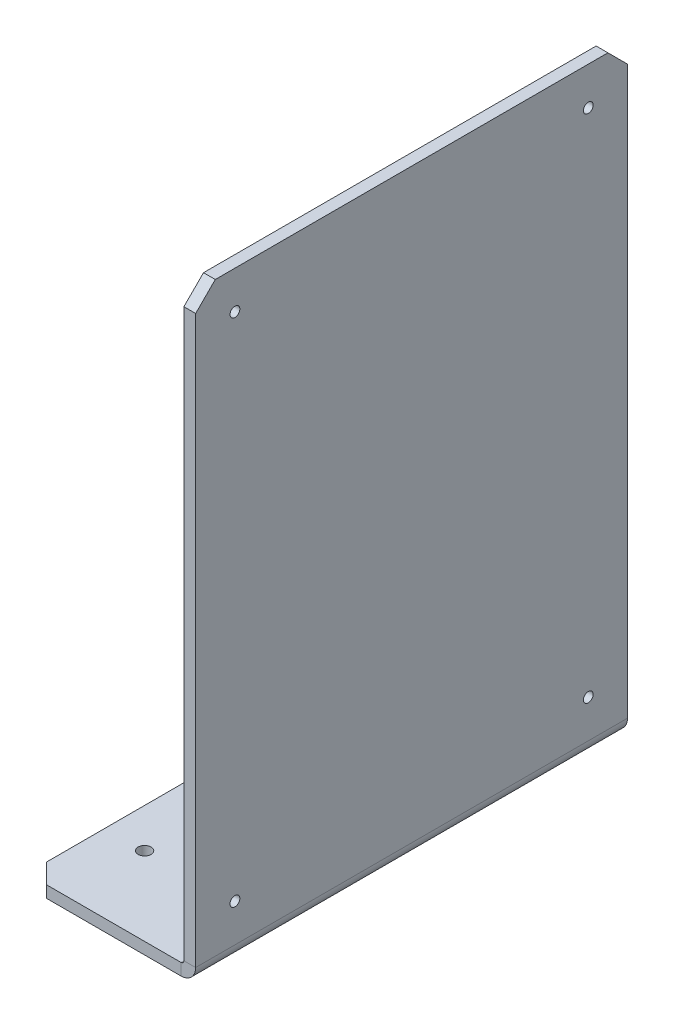
ISO-10303-21;
HEADER;
FILE_DESCRIPTION(('STEP AP214'),'2;1');
FILE_NAME('part.step','',(''),(''),'','','');
FILE_SCHEMA(('AUTOMOTIVE_DESIGN { 1 0 10303 214 1 1 1 1 }'));
ENDSEC;
DATA;
#1=APPLICATION_CONTEXT('core data for automotive mechanical design processes');
#2=APPLICATION_PROTOCOL_DEFINITION('international standard','automotive_design',2000,#1);
#3=PRODUCT_CONTEXT('',#1,'mechanical');
#4=PRODUCT('Part','Part','',(#3));
#5=PRODUCT_RELATED_PRODUCT_CATEGORY('part','',(#4));
#6=PRODUCT_DEFINITION_FORMATION('','',#4);
#7=PRODUCT_DEFINITION_CONTEXT('part definition',#1,'design');
#8=PRODUCT_DEFINITION('design','',#6,#7);
#9=PRODUCT_DEFINITION_SHAPE('','',#8);
#10=(LENGTH_UNIT() NAMED_UNIT(*) SI_UNIT(.MILLI.,.METRE.));
#11=(NAMED_UNIT(*) PLANE_ANGLE_UNIT() SI_UNIT($,.RADIAN.));
#12=(NAMED_UNIT(*) SI_UNIT($,.STERADIAN.) SOLID_ANGLE_UNIT());
#13=UNCERTAINTY_MEASURE_WITH_UNIT(LENGTH_MEASURE(1.E-05),#10,'distance_accuracy_value','');
#14=(GEOMETRIC_REPRESENTATION_CONTEXT(3) GLOBAL_UNCERTAINTY_ASSIGNED_CONTEXT((#13)) GLOBAL_UNIT_ASSIGNED_CONTEXT((#10,
#11,#12)) REPRESENTATION_CONTEXT('',''));
#15=CARTESIAN_POINT('',(0.,0.,0.));
#16=DIRECTION('',(0.,0.,1.));
#17=DIRECTION('',(1.,0.,0.));
#18=AXIS2_PLACEMENT_3D('',#15,#16,#17);
#19=CARTESIAN_POINT('',(0.,0.7366,110.));
#20=DIRECTION('',(0.,0.,1.));
#21=DIRECTION('',(1.,0.,0.));
#22=AXIS2_PLACEMENT_3D('',#19,#20,#21);
#23=PLANE('',#22);
#24=DIRECTION('',(1.,0.,0.));
#25=VECTOR('',#24,1.);
#26=CARTESIAN_POINT('',(0.,0.7366,110.));
#27=LINE('',#26,#25);
#28=CARTESIAN_POINT('',(0.,0.7366,110.));
#29=VERTEX_POINT('',#28);
#30=CARTESIAN_POINT('',(3.,0.7366,110.));
#31=VERTEX_POINT('',#30);
#32=EDGE_CURVE('E135',#29,#31,#27,.T.);
#33=ORIENTED_EDGE('',*,*,#32,.F.);
#34=CARTESIAN_POINT('',(-0.736599999999998,0.7366,110.));
#35=DIRECTION('',(0.,0.,-1.));
#36=DIRECTION('',(-1.,0.,0.));
#37=AXIS2_PLACEMENT_3D('',#34,#35,#36);
#38=CIRCLE('',#37,0.7366);
#39=CARTESIAN_POINT('',(-0.736599999999997,0.,110.));
#40=VERTEX_POINT('',#39);
#41=EDGE_CURVE('E139',#40,#29,#38,.F.);
#42=ORIENTED_EDGE('',*,*,#41,.F.);
#43=DIRECTION('',(0.,1.,0.));
#44=VECTOR('',#43,1.);
#45=CARTESIAN_POINT('',(-0.736599999999992,-3.,110.));
#46=LINE('',#45,#44);
#47=CARTESIAN_POINT('',(-0.736599999999992,-3.,110.));
#48=VERTEX_POINT('',#47);
#49=EDGE_CURVE('E144',#48,#40,#46,.T.);
#50=ORIENTED_EDGE('',*,*,#49,.F.);
#51=CARTESIAN_POINT('',(-0.736599999999998,0.7366,110.));
#52=DIRECTION('',(0.,0.,1.));
#53=DIRECTION('',(1.,0.,0.));
#54=AXIS2_PLACEMENT_3D('',#51,#52,#53);
#55=CIRCLE('',#54,3.7366);
#56=EDGE_CURVE('E141',#48,#31,#55,.T.);
#57=ORIENTED_EDGE('',*,*,#56,.T.);
#58=EDGE_LOOP('',(#33,#42,#50,#57));
#59=FACE_BOUND('',#58,.T.);
#60=ADVANCED_FACE('F41',(#59),#23,.T.);
#61=CARTESIAN_POINT('',(-0.736599999999992,-3.,110.));
#62=DIRECTION('',(0.,0.,1.));
#63=DIRECTION('',(1.,0.,0.));
#64=AXIS2_PLACEMENT_3D('',#61,#62,#63);
#65=PLANE('',#64);
#66=DIRECTION('',(0.,1.,0.));
#67=VECTOR('',#66,1.);
#68=CARTESIAN_POINT('',(3.,0.,110.));
#69=LINE('',#68,#67);
#70=CARTESIAN_POINT('',(3.,145.,110.));
#71=VERTEX_POINT('',#70);
#72=EDGE_CURVE('E159',#31,#71,#69,.T.);
#73=ORIENTED_EDGE('',*,*,#72,.T.);
#74=DIRECTION('',(-1.,0.,0.));
#75=VECTOR('',#74,1.);
#76=CARTESIAN_POINT('',(-0.736599999999992,145.,110.));
#77=LINE('',#76,#75);
#78=CARTESIAN_POINT('',(0.,145.,110.));
#79=VERTEX_POINT('',#78);
#80=EDGE_CURVE('E65',#71,#79,#77,.T.);
#81=ORIENTED_EDGE('',*,*,#80,.T.);
#82=DIRECTION('',(0.,1.,0.));
#83=VECTOR('',#82,1.);
#84=CARTESIAN_POINT('',(0.,0.,110.));
#85=LINE('',#84,#83);
#86=EDGE_CURVE('E149',#29,#79,#85,.T.);
#87=ORIENTED_EDGE('',*,*,#86,.F.);
#88=ORIENTED_EDGE('',*,*,#32,.T.);
#89=EDGE_LOOP('',(#73,#81,#87,#88));
#90=FACE_BOUND('',#89,.T.);
#91=ADVANCED_FACE('F158',(#90),#65,.T.);
#92=CARTESIAN_POINT('',(-0.736599999999997,0.,0.));
#93=DIRECTION('',(0.,0.,-1.));
#94=DIRECTION('',(-1.,0.,0.));
#95=AXIS2_PLACEMENT_3D('',#92,#93,#94);
#96=PLANE('',#95);
#97=DIRECTION('',(0.,-1.,0.));
#98=VECTOR('',#97,1.);
#99=CARTESIAN_POINT('',(-0.736599999999997,0.,0.));
#100=LINE('',#99,#98);
#101=CARTESIAN_POINT('',(-0.736599999999997,0.,0.));
#102=VERTEX_POINT('',#101);
#103=CARTESIAN_POINT('',(-0.736599999999992,-3.,0.));
#104=VERTEX_POINT('',#103);
#105=EDGE_CURVE('E205',#102,#104,#100,.T.);
#106=ORIENTED_EDGE('',*,*,#105,.F.);
#107=CARTESIAN_POINT('',(-0.736599999999998,0.7366,0.));
#108=DIRECTION('',(0.,0.,-1.));
#109=DIRECTION('',(-1.,0.,0.));
#110=AXIS2_PLACEMENT_3D('',#107,#108,#109);
#111=CIRCLE('',#110,0.7366);
#112=CARTESIAN_POINT('',(0.,0.7366,0.));
#113=VERTEX_POINT('',#112);
#114=EDGE_CURVE('E178',#102,#113,#111,.F.);
#115=ORIENTED_EDGE('',*,*,#114,.T.);
#116=DIRECTION('',(-1.,0.,0.));
#117=VECTOR('',#116,1.);
#118=CARTESIAN_POINT('',(3.,0.7366,0.));
#119=LINE('',#118,#117);
#120=CARTESIAN_POINT('',(3.,0.7366,0.));
#121=VERTEX_POINT('',#120);
#122=EDGE_CURVE('E203',#121,#113,#119,.T.);
#123=ORIENTED_EDGE('',*,*,#122,.F.);
#124=CARTESIAN_POINT('',(-0.736599999999998,0.7366,0.));
#125=DIRECTION('',(0.,0.,1.));
#126=DIRECTION('',(1.,0.,0.));
#127=AXIS2_PLACEMENT_3D('',#124,#125,#126);
#128=CIRCLE('',#127,3.7366);
#129=EDGE_CURVE('E184',#104,#121,#128,.T.);
#130=ORIENTED_EDGE('',*,*,#129,.F.);
#131=EDGE_LOOP('',(#106,#115,#123,#130));
#132=FACE_BOUND('',#131,.T.);
#133=ADVANCED_FACE('F317',(#132),#96,.T.);
#134=CARTESIAN_POINT('',(3.,0.7366,0.));
#135=DIRECTION('',(0.,0.,-1.));
#136=DIRECTION('',(-1.,0.,0.));
#137=AXIS2_PLACEMENT_3D('',#134,#135,#136);
#138=PLANE('',#137);
#139=DIRECTION('',(1.,0.,0.));
#140=VECTOR('',#139,1.);
#141=CARTESIAN_POINT('',(-40.,-3.,0.));
#142=LINE('',#141,#140);
#143=CARTESIAN_POINT('',(-35.,-3.,0.));
#144=VERTEX_POINT('',#143);
#145=EDGE_CURVE('E182',#144,#104,#142,.T.);
#146=ORIENTED_EDGE('',*,*,#145,.F.);
#147=DIRECTION('',(0.,1.,0.));
#148=VECTOR('',#147,1.);
#149=CARTESIAN_POINT('',(-35.,0.7366,0.));
#150=LINE('',#149,#148);
#151=CARTESIAN_POINT('',(-35.,0.,0.));
#152=VERTEX_POINT('',#151);
#153=EDGE_CURVE('E143',#144,#152,#150,.T.);
#154=ORIENTED_EDGE('',*,*,#153,.T.);
#155=DIRECTION('',(1.,0.,0.));
#156=VECTOR('',#155,1.);
#157=CARTESIAN_POINT('',(-40.,0.,0.));
#158=LINE('',#157,#156);
#159=EDGE_CURVE('E180',#152,#102,#158,.T.);
#160=ORIENTED_EDGE('',*,*,#159,.T.);
#161=ORIENTED_EDGE('',*,*,#105,.T.);
#162=EDGE_LOOP('',(#146,#154,#160,#161));
#163=FACE_BOUND('',#162,.T.);
#164=ADVANCED_FACE('F313',(#163),#138,.T.);
#165=CARTESIAN_POINT('',(3.,0.,110.));
#166=DIRECTION('',(-1.,0.,0.));
#167=DIRECTION('',(0.,0.,1.));
#168=AXIS2_PLACEMENT_3D('',#165,#166,#167);
#169=PLANE('',#168);
#170=CARTESIAN_POINT('',(3.,140.3683,10.));
#171=DIRECTION('',(-1.,0.,0.));
#172=DIRECTION('',(0.,0.,1.));
#173=AXIS2_PLACEMENT_3D('',#170,#171,#172);
#174=CIRCLE('',#173,1.25);
#175=CARTESIAN_POINT('',(3.,140.3683,11.25));
#176=VERTEX_POINT('',#175);
#177=EDGE_CURVE('E266',#176,#176,#174,.T.);
#178=ORIENTED_EDGE('',*,*,#177,.T.);
#179=EDGE_LOOP('',(#178));
#180=FACE_BOUND('',#179,.T.);
#181=CARTESIAN_POINT('',(3.,140.3683,100.));
#182=DIRECTION('',(-1.,0.,0.));
#183=DIRECTION('',(0.,0.,1.));
#184=AXIS2_PLACEMENT_3D('',#181,#182,#183);
#185=CIRCLE('',#184,1.25);
#186=CARTESIAN_POINT('',(3.,140.3683,101.25));
#187=VERTEX_POINT('',#186);
#188=EDGE_CURVE('E260',#187,#187,#185,.T.);
#189=ORIENTED_EDGE('',*,*,#188,.T.);
#190=EDGE_LOOP('',(#189));
#191=FACE_BOUND('',#190,.T.);
#192=CARTESIAN_POINT('',(3.,10.3683,100.));
#193=DIRECTION('',(-1.,0.,0.));
#194=DIRECTION('',(0.,0.,1.));
#195=AXIS2_PLACEMENT_3D('',#192,#193,#194);
#196=CIRCLE('',#195,1.24999999999999);
#197=CARTESIAN_POINT('',(3.,10.3683,101.25));
#198=VERTEX_POINT('',#197);
#199=EDGE_CURVE('E254',#198,#198,#196,.T.);
#200=ORIENTED_EDGE('',*,*,#199,.T.);
#201=EDGE_LOOP('',(#200));
#202=FACE_BOUND('',#201,.T.);
#203=CARTESIAN_POINT('',(3.,10.3683,9.99999999999998));
#204=DIRECTION('',(-1.,0.,0.));
#205=DIRECTION('',(0.,0.,1.));
#206=AXIS2_PLACEMENT_3D('',#203,#204,#205);
#207=CIRCLE('',#206,1.24999999999999);
#208=CARTESIAN_POINT('',(3.,10.3683,11.25));
#209=VERTEX_POINT('',#208);
#210=EDGE_CURVE('E176',#209,#209,#207,.T.);
#211=ORIENTED_EDGE('',*,*,#210,.T.);
#212=EDGE_LOOP('',(#211));
#213=FACE_BOUND('',#212,.T.);
#214=DIRECTION('',(0.,0.,-1.));
#215=VECTOR('',#214,1.);
#216=CARTESIAN_POINT('',(3.,150.,110.));
#217=LINE('',#216,#215);
#218=CARTESIAN_POINT('',(3.,150.,105.));
#219=VERTEX_POINT('',#218);
#220=CARTESIAN_POINT('',(3.,150.,5.00000000000003));
#221=VERTEX_POINT('',#220);
#222=EDGE_CURVE('E200',#219,#221,#217,.T.);
#223=ORIENTED_EDGE('',*,*,#222,.F.);
#224=DIRECTION('',(0.,0.707106781186549,-0.707106781186546));
#225=VECTOR('',#224,1.);
#226=CARTESIAN_POINT('',(3.,150.,105.));
#227=LINE('',#226,#225);
#228=EDGE_CURVE('E234',#219,#71,#227,.F.);
#229=ORIENTED_EDGE('',*,*,#228,.T.);
#230=ORIENTED_EDGE('',*,*,#72,.F.);
#231=DIRECTION('',(0.,0.,-1.));
#232=VECTOR('',#231,1.);
#233=CARTESIAN_POINT('',(3.,0.7366,110.));
#234=LINE('',#233,#232);
#235=EDGE_CURVE('E172',#31,#121,#234,.T.);
#236=ORIENTED_EDGE('',*,*,#235,.T.);
#237=DIRECTION('',(0.,1.,0.));
#238=VECTOR('',#237,1.);
#239=CARTESIAN_POINT('',(3.,0.,0.));
#240=LINE('',#239,#238);
#241=CARTESIAN_POINT('',(3.,145.,0.));
#242=VERTEX_POINT('',#241);
#243=EDGE_CURVE('E173',#121,#242,#240,.T.);
#244=ORIENTED_EDGE('',*,*,#243,.T.);
#245=DIRECTION('',(0.,-0.707106781186546,-0.707106781186549));
#246=VECTOR('',#245,1.);
#247=CARTESIAN_POINT('',(3.,145.,0.));
#248=LINE('',#247,#246);
#249=EDGE_CURVE('E232',#242,#221,#248,.F.);
#250=ORIENTED_EDGE('',*,*,#249,.T.);
#251=EDGE_LOOP('',(#223,#229,#230,#236,#244,#250));
#252=FACE_BOUND('',#251,.T.);
#253=ADVANCED_FACE('F247',(#180,#191,#202,#213,#252),#169,.F.);
#254=CARTESIAN_POINT('',(0.,150.,110.));
#255=DIRECTION('',(0.,1.,0.));
#256=DIRECTION('',(0.,0.,1.));
#257=AXIS2_PLACEMENT_3D('',#254,#255,#256);
#258=PLANE('',#257);
#259=DIRECTION('',(0.,0.,-1.));
#260=VECTOR('',#259,1.);
#261=CARTESIAN_POINT('',(0.,150.,110.));
#262=LINE('',#261,#260);
#263=CARTESIAN_POINT('',(0.,150.,105.));
#264=VERTEX_POINT('',#263);
#265=CARTESIAN_POINT('',(0.,150.,5.00000000000003));
#266=VERTEX_POINT('',#265);
#267=EDGE_CURVE('E155',#264,#266,#262,.T.);
#268=ORIENTED_EDGE('',*,*,#267,.F.);
#269=DIRECTION('',(1.,0.,0.));
#270=VECTOR('',#269,1.);
#271=CARTESIAN_POINT('',(0.,150.,105.));
#272=LINE('',#271,#270);
#273=EDGE_CURVE('E229',#264,#219,#272,.T.);
#274=ORIENTED_EDGE('',*,*,#273,.T.);
#275=ORIENTED_EDGE('',*,*,#222,.T.);
#276=DIRECTION('',(-1.,0.,0.));
#277=VECTOR('',#276,1.);
#278=CARTESIAN_POINT('',(0.,150.,5.00000000000003));
#279=LINE('',#278,#277);
#280=EDGE_CURVE('E227',#221,#266,#279,.T.);
#281=ORIENTED_EDGE('',*,*,#280,.T.);
#282=EDGE_LOOP('',(#268,#274,#275,#281));
#283=FACE_BOUND('',#282,.T.);
#284=ADVANCED_FACE('F241',(#283),#258,.T.);
#285=CARTESIAN_POINT('',(0.,0.,110.));
#286=DIRECTION('',(-1.,0.,0.));
#287=DIRECTION('',(0.,0.,1.));
#288=AXIS2_PLACEMENT_3D('',#285,#286,#287);
#289=PLANE('',#288);
#290=CARTESIAN_POINT('',(0.,140.3683,10.));
#291=DIRECTION('',(-1.,0.,0.));
#292=DIRECTION('',(0.,0.,1.));
#293=AXIS2_PLACEMENT_3D('',#290,#291,#292);
#294=CIRCLE('',#293,1.25);
#295=CARTESIAN_POINT('',(0.,140.3683,11.25));
#296=VERTEX_POINT('',#295);
#297=EDGE_CURVE('E269',#296,#296,#294,.T.);
#298=ORIENTED_EDGE('',*,*,#297,.F.);
#299=EDGE_LOOP('',(#298));
#300=FACE_BOUND('',#299,.T.);
#301=CARTESIAN_POINT('',(0.,140.3683,100.));
#302=DIRECTION('',(-1.,0.,0.));
#303=DIRECTION('',(0.,0.,1.));
#304=AXIS2_PLACEMENT_3D('',#301,#302,#303);
#305=CIRCLE('',#304,1.25);
#306=CARTESIAN_POINT('',(0.,140.3683,101.25));
#307=VERTEX_POINT('',#306);
#308=EDGE_CURVE('E263',#307,#307,#305,.T.);
#309=ORIENTED_EDGE('',*,*,#308,.F.);
#310=EDGE_LOOP('',(#309));
#311=FACE_BOUND('',#310,.T.);
#312=CARTESIAN_POINT('',(0.,10.3683,100.));
#313=DIRECTION('',(-1.,0.,0.));
#314=DIRECTION('',(0.,0.,1.));
#315=AXIS2_PLACEMENT_3D('',#312,#313,#314);
#316=CIRCLE('',#315,1.24999999999999);
#317=CARTESIAN_POINT('',(0.,10.3683,101.25));
#318=VERTEX_POINT('',#317);
#319=EDGE_CURVE('E257',#318,#318,#316,.T.);
#320=ORIENTED_EDGE('',*,*,#319,.F.);
#321=EDGE_LOOP('',(#320));
#322=FACE_BOUND('',#321,.T.);
#323=CARTESIAN_POINT('',(0.,10.3683,9.99999999999998));
#324=DIRECTION('',(-1.,0.,0.));
#325=DIRECTION('',(0.,0.,1.));
#326=AXIS2_PLACEMENT_3D('',#323,#324,#325);
#327=CIRCLE('',#326,1.24999999999999);
#328=CARTESIAN_POINT('',(0.,10.3683,11.25));
#329=VERTEX_POINT('',#328);
#330=EDGE_CURVE('E251',#329,#329,#327,.T.);
#331=ORIENTED_EDGE('',*,*,#330,.F.);
#332=EDGE_LOOP('',(#331));
#333=FACE_BOUND('',#332,.T.);
#334=ORIENTED_EDGE('',*,*,#86,.T.);
#335=DIRECTION('',(0.,-0.707106781186549,0.707106781186546));
#336=VECTOR('',#335,1.);
#337=CARTESIAN_POINT('',(0.,72.4999999999996,182.5));
#338=LINE('',#337,#336);
#339=EDGE_CURVE('E50',#79,#264,#338,.F.);
#340=ORIENTED_EDGE('',*,*,#339,.T.);
#341=ORIENTED_EDGE('',*,*,#267,.T.);
#342=DIRECTION('',(0.,0.707106781186546,0.707106781186549));
#343=VECTOR('',#342,1.);
#344=CARTESIAN_POINT('',(0.,127.5,-17.4999999999997));
#345=LINE('',#344,#343);
#346=CARTESIAN_POINT('',(0.,145.,0.));
#347=VERTEX_POINT('',#346);
#348=EDGE_CURVE('E57',#266,#347,#345,.F.);
#349=ORIENTED_EDGE('',*,*,#348,.T.);
#350=DIRECTION('',(0.,1.,0.));
#351=VECTOR('',#350,1.);
#352=CARTESIAN_POINT('',(0.,0.,0.));
#353=LINE('',#352,#351);
#354=EDGE_CURVE('E151',#113,#347,#353,.T.);
#355=ORIENTED_EDGE('',*,*,#354,.F.);
#356=DIRECTION('',(0.,0.,-1.));
#357=VECTOR('',#356,1.);
#358=CARTESIAN_POINT('',(0.,0.7366,110.));
#359=LINE('',#358,#357);
#360=EDGE_CURVE('E147',#29,#113,#359,.T.);
#361=ORIENTED_EDGE('',*,*,#360,.F.);
#362=EDGE_LOOP('',(#334,#340,#341,#349,#355,#361));
#363=FACE_BOUND('',#362,.T.);
#364=ADVANCED_FACE('F148',(#300,#311,#322,#333,#363),#289,.T.);
#365=CARTESIAN_POINT('',(-0.736599999999998,0.7366,110.));
#366=DIRECTION('',(0.,0.,-1.));
#367=DIRECTION('',(-1.,0.,0.));
#368=AXIS2_PLACEMENT_3D('',#365,#366,#367);
#369=CYLINDRICAL_SURFACE('',#368,0.7366);
#370=ORIENTED_EDGE('',*,*,#114,.F.);
#371=DIRECTION('',(0.,0.,-1.));
#372=VECTOR('',#371,1.);
#373=CARTESIAN_POINT('',(-0.736599999999997,0.,110.));
#374=LINE('',#373,#372);
#375=EDGE_CURVE('E156',#40,#102,#374,.T.);
#376=ORIENTED_EDGE('',*,*,#375,.F.);
#377=ORIENTED_EDGE('',*,*,#41,.T.);
#378=ORIENTED_EDGE('',*,*,#360,.T.);
#379=EDGE_LOOP('',(#370,#376,#377,#378));
#380=FACE_BOUND('',#379,.T.);
#381=ADVANCED_FACE('F162',(#380),#369,.F.);
#382=CARTESIAN_POINT('',(-40.,0.,110.));
#383=DIRECTION('',(0.,1.,0.));
#384=DIRECTION('',(0.,0.,1.));
#385=AXIS2_PLACEMENT_3D('',#382,#383,#384);
#386=PLANE('',#385);
#387=CARTESIAN_POINT('',(-30.,0.,20.));
#388=DIRECTION('',(0.,1.,0.));
#389=DIRECTION('',(0.,0.,1.));
#390=AXIS2_PLACEMENT_3D('',#387,#388,#389);
#391=CIRCLE('',#390,1.65);
#392=CARTESIAN_POINT('',(-30.,0.,21.65));
#393=VERTEX_POINT('',#392);
#394=EDGE_CURVE('E283',#393,#393,#391,.T.);
#395=ORIENTED_EDGE('',*,*,#394,.F.);
#396=EDGE_LOOP('',(#395));
#397=FACE_BOUND('',#396,.T.);
#398=CARTESIAN_POINT('',(-30.,0.,90.));
#399=DIRECTION('',(0.,1.,0.));
#400=DIRECTION('',(0.,0.,1.));
#401=AXIS2_PLACEMENT_3D('',#398,#399,#400);
#402=CIRCLE('',#401,1.65);
#403=CARTESIAN_POINT('',(-30.,0.,91.65));
#404=VERTEX_POINT('',#403);
#405=EDGE_CURVE('E282',#404,#404,#402,.T.);
#406=ORIENTED_EDGE('',*,*,#405,.F.);
#407=EDGE_LOOP('',(#406));
#408=FACE_BOUND('',#407,.T.);
#409=CARTESIAN_POINT('',(-10.,0.,90.));
#410=DIRECTION('',(0.,1.,0.));
#411=DIRECTION('',(0.,0.,1.));
#412=AXIS2_PLACEMENT_3D('',#409,#410,#411);
#413=CIRCLE('',#412,1.65);
#414=CARTESIAN_POINT('',(-10.,0.,91.65));
#415=VERTEX_POINT('',#414);
#416=EDGE_CURVE('E289',#415,#415,#413,.T.);
#417=ORIENTED_EDGE('',*,*,#416,.F.);
#418=EDGE_LOOP('',(#417));
#419=FACE_BOUND('',#418,.T.);
#420=CARTESIAN_POINT('',(-10.,0.,20.));
#421=DIRECTION('',(0.,1.,0.));
#422=DIRECTION('',(0.,0.,1.));
#423=AXIS2_PLACEMENT_3D('',#420,#421,#422);
#424=CIRCLE('',#423,1.65);
#425=CARTESIAN_POINT('',(-10.,0.,21.65));
#426=VERTEX_POINT('',#425);
#427=EDGE_CURVE('E275',#426,#426,#424,.T.);
#428=ORIENTED_EDGE('',*,*,#427,.F.);
#429=EDGE_LOOP('',(#428));
#430=FACE_BOUND('',#429,.T.);
#431=ORIENTED_EDGE('',*,*,#159,.F.);
#432=DIRECTION('',(0.707106781186546,0.,-0.707106781186549));
#433=VECTOR('',#432,1.);
#434=CARTESIAN_POINT('',(-92.5,0.,57.5000000000003));
#435=LINE('',#434,#433);
#436=CARTESIAN_POINT('',(-40.,0.,5.00000000000003));
#437=VERTEX_POINT('',#436);
#438=EDGE_CURVE('E214',#152,#437,#435,.F.);
#439=ORIENTED_EDGE('',*,*,#438,.T.);
#440=DIRECTION('',(0.,0.,-1.));
#441=VECTOR('',#440,1.);
#442=CARTESIAN_POINT('',(-40.,0.,110.));
#443=LINE('',#442,#441);
#444=CARTESIAN_POINT('',(-40.,0.,105.));
#445=VERTEX_POINT('',#444);
#446=EDGE_CURVE('E195',#445,#437,#443,.T.);
#447=ORIENTED_EDGE('',*,*,#446,.F.);
#448=DIRECTION('',(0.707106781186549,0.,0.707106781186546));
#449=VECTOR('',#448,1.);
#450=CARTESIAN_POINT('',(-37.5,0.,107.5));
#451=LINE('',#450,#449);
#452=CARTESIAN_POINT('',(-35.,0.,110.));
#453=VERTEX_POINT('',#452);
#454=EDGE_CURVE('E212',#445,#453,#451,.T.);
#455=ORIENTED_EDGE('',*,*,#454,.T.);
#456=DIRECTION('',(1.,0.,0.));
#457=VECTOR('',#456,1.);
#458=CARTESIAN_POINT('',(-40.,0.,110.));
#459=LINE('',#458,#457);
#460=EDGE_CURVE('E164',#453,#40,#459,.T.);
#461=ORIENTED_EDGE('',*,*,#460,.T.);
#462=ORIENTED_EDGE('',*,*,#375,.T.);
#463=EDGE_LOOP('',(#431,#439,#447,#455,#461,#462));
#464=FACE_BOUND('',#463,.T.);
#465=ADVANCED_FACE('F300',(#397,#408,#419,#430,#464),#386,.T.);
#466=CARTESIAN_POINT('',(-40.,-3.,110.));
#467=DIRECTION('',(-1.,0.,0.));
#468=DIRECTION('',(0.,0.,1.));
#469=AXIS2_PLACEMENT_3D('',#466,#467,#468);
#470=PLANE('',#469);
#471=ORIENTED_EDGE('',*,*,#446,.T.);
#472=DIRECTION('',(0.,-1.,0.));
#473=VECTOR('',#472,1.);
#474=CARTESIAN_POINT('',(-40.,-3.,5.00000000000003));
#475=LINE('',#474,#473);
#476=CARTESIAN_POINT('',(-40.,-3.,5.00000000000003));
#477=VERTEX_POINT('',#476);
#478=EDGE_CURVE('E219',#437,#477,#475,.T.);
#479=ORIENTED_EDGE('',*,*,#478,.T.);
#480=DIRECTION('',(0.,0.,-1.));
#481=VECTOR('',#480,1.);
#482=CARTESIAN_POINT('',(-40.,-3.,110.));
#483=LINE('',#482,#481);
#484=CARTESIAN_POINT('',(-40.,-3.,105.));
#485=VERTEX_POINT('',#484);
#486=EDGE_CURVE('E192',#485,#477,#483,.T.);
#487=ORIENTED_EDGE('',*,*,#486,.F.);
#488=DIRECTION('',(0.,1.,0.));
#489=VECTOR('',#488,1.);
#490=CARTESIAN_POINT('',(-40.,0.,105.));
#491=LINE('',#490,#489);
#492=EDGE_CURVE('E216',#485,#445,#491,.T.);
#493=ORIENTED_EDGE('',*,*,#492,.T.);
#494=EDGE_LOOP('',(#471,#479,#487,#493));
#495=FACE_BOUND('',#494,.T.);
#496=ADVANCED_FACE('F303',(#495),#470,.T.);
#497=CARTESIAN_POINT('',(-40.,-3.,110.));
#498=DIRECTION('',(0.,1.,0.));
#499=DIRECTION('',(0.,0.,1.));
#500=AXIS2_PLACEMENT_3D('',#497,#498,#499);
#501=PLANE('',#500);
#502=CARTESIAN_POINT('',(-30.,-3.,20.));
#503=DIRECTION('',(0.,1.,0.));
#504=DIRECTION('',(0.,0.,1.));
#505=AXIS2_PLACEMENT_3D('',#502,#503,#504);
#506=CIRCLE('',#505,1.65);
#507=CARTESIAN_POINT('',(-30.,-3.,21.65));
#508=VERTEX_POINT('',#507);
#509=EDGE_CURVE('E279',#508,#508,#506,.F.);
#510=ORIENTED_EDGE('',*,*,#509,.F.);
#511=EDGE_LOOP('',(#510));
#512=FACE_BOUND('',#511,.T.);
#513=CARTESIAN_POINT('',(-30.,-3.,90.));
#514=DIRECTION('',(0.,1.,0.));
#515=DIRECTION('',(0.,0.,1.));
#516=AXIS2_PLACEMENT_3D('',#513,#514,#515);
#517=CIRCLE('',#516,1.65);
#518=CARTESIAN_POINT('',(-30.,-3.,91.65));
#519=VERTEX_POINT('',#518);
#520=EDGE_CURVE('E286',#519,#519,#517,.F.);
#521=ORIENTED_EDGE('',*,*,#520,.F.);
#522=EDGE_LOOP('',(#521));
#523=FACE_BOUND('',#522,.T.);
#524=CARTESIAN_POINT('',(-10.,-3.,90.));
#525=DIRECTION('',(0.,1.,0.));
#526=DIRECTION('',(0.,0.,1.));
#527=AXIS2_PLACEMENT_3D('',#524,#525,#526);
#528=CIRCLE('',#527,1.65);
#529=CARTESIAN_POINT('',(-10.,-3.,91.65));
#530=VERTEX_POINT('',#529);
#531=EDGE_CURVE('E278',#530,#530,#528,.F.);
#532=ORIENTED_EDGE('',*,*,#531,.F.);
#533=EDGE_LOOP('',(#532));
#534=FACE_BOUND('',#533,.T.);
#535=CARTESIAN_POINT('',(-10.,-3.,20.));
#536=DIRECTION('',(0.,1.,0.));
#537=DIRECTION('',(0.,0.,1.));
#538=AXIS2_PLACEMENT_3D('',#535,#536,#537);
#539=CIRCLE('',#538,1.65);
#540=CARTESIAN_POINT('',(-10.,-3.,21.65));
#541=VERTEX_POINT('',#540);
#542=EDGE_CURVE('E272',#541,#541,#539,.F.);
#543=ORIENTED_EDGE('',*,*,#542,.F.);
#544=EDGE_LOOP('',(#543));
#545=FACE_BOUND('',#544,.T.);
#546=ORIENTED_EDGE('',*,*,#486,.T.);
#547=DIRECTION('',(-0.707106781186546,0.,0.707106781186549));
#548=VECTOR('',#547,1.);
#549=CARTESIAN_POINT('',(-35.,-3.,0.));
#550=LINE('',#549,#548);
#551=EDGE_CURVE('E223',#477,#144,#550,.F.);
#552=ORIENTED_EDGE('',*,*,#551,.T.);
#553=ORIENTED_EDGE('',*,*,#145,.T.);
#554=DIRECTION('',(0.,0.,-1.));
#555=VECTOR('',#554,1.);
#556=CARTESIAN_POINT('',(-0.736599999999992,-3.,110.));
#557=LINE('',#556,#555);
#558=EDGE_CURVE('E189',#48,#104,#557,.T.);
#559=ORIENTED_EDGE('',*,*,#558,.F.);
#560=DIRECTION('',(1.,0.,0.));
#561=VECTOR('',#560,1.);
#562=CARTESIAN_POINT('',(-40.,-3.,110.));
#563=LINE('',#562,#561);
#564=CARTESIAN_POINT('',(-35.,-3.,110.));
#565=VERTEX_POINT('',#564);
#566=EDGE_CURVE('E166',#565,#48,#563,.T.);
#567=ORIENTED_EDGE('',*,*,#566,.F.);
#568=DIRECTION('',(-0.707106781186549,0.,-0.707106781186546));
#569=VECTOR('',#568,1.);
#570=CARTESIAN_POINT('',(-40.,-3.,105.));
#571=LINE('',#570,#569);
#572=EDGE_CURVE('E221',#565,#485,#571,.T.);
#573=ORIENTED_EDGE('',*,*,#572,.T.);
#574=EDGE_LOOP('',(#546,#552,#553,#559,#567,#573));
#575=FACE_BOUND('',#574,.T.);
#576=ADVANCED_FACE('F369',(#512,#523,#534,#545,#575),#501,.F.);
#577=CARTESIAN_POINT('',(-0.736599999999998,0.7366,110.));
#578=DIRECTION('',(0.,0.,-1.));
#579=DIRECTION('',(-1.,0.,0.));
#580=AXIS2_PLACEMENT_3D('',#577,#578,#579);
#581=CYLINDRICAL_SURFACE('',#580,3.7366);
#582=ORIENTED_EDGE('',*,*,#129,.T.);
#583=ORIENTED_EDGE('',*,*,#235,.F.);
#584=ORIENTED_EDGE('',*,*,#56,.F.);
#585=ORIENTED_EDGE('',*,*,#558,.T.);
#586=EDGE_LOOP('',(#582,#583,#584,#585));
#587=FACE_BOUND('',#586,.T.);
#588=ADVANCED_FACE('F319',(#587),#581,.T.);
#589=CARTESIAN_POINT('',(-0.736599999999998,0.7366,110.));
#590=DIRECTION('',(0.,0.,-1.));
#591=DIRECTION('',(-1.,0.,0.));
#592=AXIS2_PLACEMENT_3D('',#589,#590,#591);
#593=PLANE('',#592);
#594=ORIENTED_EDGE('',*,*,#460,.F.);
#595=DIRECTION('',(0.,-1.,0.));
#596=VECTOR('',#595,1.);
#597=CARTESIAN_POINT('',(-35.,-3.,110.));
#598=LINE('',#597,#596);
#599=EDGE_CURVE('E225',#453,#565,#598,.T.);
#600=ORIENTED_EDGE('',*,*,#599,.T.);
#601=ORIENTED_EDGE('',*,*,#566,.T.);
#602=ORIENTED_EDGE('',*,*,#49,.T.);
#603=EDGE_LOOP('',(#594,#600,#601,#602));
#604=FACE_BOUND('',#603,.T.);
#605=ADVANCED_FACE('F375',(#604),#593,.F.);
#606=CARTESIAN_POINT('',(-0.736599999999998,0.7366,0.));
#607=DIRECTION('',(0.,0.,-1.));
#608=DIRECTION('',(-1.,0.,0.));
#609=AXIS2_PLACEMENT_3D('',#606,#607,#608);
#610=PLANE('',#609);
#611=ORIENTED_EDGE('',*,*,#354,.T.);
#612=DIRECTION('',(1.,0.,0.));
#613=VECTOR('',#612,1.);
#614=CARTESIAN_POINT('',(-0.736599999999998,145.,0.));
#615=LINE('',#614,#613);
#616=EDGE_CURVE('E11',#347,#242,#615,.T.);
#617=ORIENTED_EDGE('',*,*,#616,.T.);
#618=ORIENTED_EDGE('',*,*,#243,.F.);
#619=ORIENTED_EDGE('',*,*,#122,.T.);
#620=EDGE_LOOP('',(#611,#617,#618,#619));
#621=FACE_BOUND('',#620,.T.);
#622=ADVANCED_FACE('F323',(#621),#610,.T.);
#623=CARTESIAN_POINT('',(0.,10.3683,9.99999999999998));
#624=DIRECTION('',(-1.,0.,0.));
#625=DIRECTION('',(0.,0.,1.));
#626=AXIS2_PLACEMENT_3D('',#623,#624,#625);
#627=CYLINDRICAL_SURFACE('',#626,1.24999999999999);
#628=ORIENTED_EDGE('',*,*,#330,.T.);
#629=EDGE_LOOP('',(#628));
#630=FACE_BOUND('',#629,.T.);
#631=ORIENTED_EDGE('',*,*,#210,.F.);
#632=EDGE_LOOP('',(#631));
#633=FACE_BOUND('',#632,.T.);
#634=ADVANCED_FACE('F382',(#630,#633),#627,.F.);
#635=CARTESIAN_POINT('',(0.,10.3683,100.));
#636=DIRECTION('',(-1.,0.,0.));
#637=DIRECTION('',(0.,0.,1.));
#638=AXIS2_PLACEMENT_3D('',#635,#636,#637);
#639=CYLINDRICAL_SURFACE('',#638,1.24999999999999);
#640=ORIENTED_EDGE('',*,*,#319,.T.);
#641=EDGE_LOOP('',(#640));
#642=FACE_BOUND('',#641,.T.);
#643=ORIENTED_EDGE('',*,*,#199,.F.);
#644=EDGE_LOOP('',(#643));
#645=FACE_BOUND('',#644,.T.);
#646=ADVANCED_FACE('F458',(#642,#645),#639,.F.);
#647=CARTESIAN_POINT('',(0.,140.3683,100.));
#648=DIRECTION('',(-1.,0.,0.));
#649=DIRECTION('',(0.,0.,1.));
#650=AXIS2_PLACEMENT_3D('',#647,#648,#649);
#651=CYLINDRICAL_SURFACE('',#650,1.25);
#652=ORIENTED_EDGE('',*,*,#308,.T.);
#653=EDGE_LOOP('',(#652));
#654=FACE_BOUND('',#653,.T.);
#655=ORIENTED_EDGE('',*,*,#188,.F.);
#656=EDGE_LOOP('',(#655));
#657=FACE_BOUND('',#656,.T.);
#658=ADVANCED_FACE('F470',(#654,#657),#651,.F.);
#659=CARTESIAN_POINT('',(0.,140.3683,10.));
#660=DIRECTION('',(-1.,0.,0.));
#661=DIRECTION('',(0.,0.,1.));
#662=AXIS2_PLACEMENT_3D('',#659,#660,#661);
#663=CYLINDRICAL_SURFACE('',#662,1.25);
#664=ORIENTED_EDGE('',*,*,#297,.T.);
#665=EDGE_LOOP('',(#664));
#666=FACE_BOUND('',#665,.T.);
#667=ORIENTED_EDGE('',*,*,#177,.F.);
#668=EDGE_LOOP('',(#667));
#669=FACE_BOUND('',#668,.T.);
#670=ADVANCED_FACE('F350',(#666,#669),#663,.F.);
#671=CARTESIAN_POINT('',(-35.,0.7366,0.));
#672=DIRECTION('',(0.707106781186549,0.,0.707106781186545));
#673=DIRECTION('',(0.,1.,0.));
#674=AXIS2_PLACEMENT_3D('',#671,#672,#673);
#675=PLANE('',#674);
#676=ORIENTED_EDGE('',*,*,#551,.F.);
#677=ORIENTED_EDGE('',*,*,#478,.F.);
#678=ORIENTED_EDGE('',*,*,#438,.F.);
#679=ORIENTED_EDGE('',*,*,#153,.F.);
#680=EDGE_LOOP('',(#676,#677,#678,#679));
#681=FACE_BOUND('',#680,.T.);
#682=ADVANCED_FACE('F344',(#681),#675,.F.);
#683=CARTESIAN_POINT('',(-40.,-3.,105.));
#684=DIRECTION('',(-0.707106781186545,0.,0.707106781186549));
#685=DIRECTION('',(0.,-1.,0.));
#686=AXIS2_PLACEMENT_3D('',#683,#684,#685);
#687=PLANE('',#686);
#688=ORIENTED_EDGE('',*,*,#572,.F.);
#689=ORIENTED_EDGE('',*,*,#599,.F.);
#690=ORIENTED_EDGE('',*,*,#454,.F.);
#691=ORIENTED_EDGE('',*,*,#492,.F.);
#692=EDGE_LOOP('',(#688,#689,#690,#691));
#693=FACE_BOUND('',#692,.T.);
#694=ADVANCED_FACE('F334',(#693),#687,.T.);
#695=CARTESIAN_POINT('',(0.,150.,105.));
#696=DIRECTION('',(0.,-0.707106781186545,-0.707106781186549));
#697=DIRECTION('',(1.,0.,0.));
#698=AXIS2_PLACEMENT_3D('',#695,#696,#697);
#699=PLANE('',#698);
#700=ORIENTED_EDGE('',*,*,#339,.F.);
#701=ORIENTED_EDGE('',*,*,#80,.F.);
#702=ORIENTED_EDGE('',*,*,#228,.F.);
#703=ORIENTED_EDGE('',*,*,#273,.F.);
#704=EDGE_LOOP('',(#700,#701,#702,#703));
#705=FACE_BOUND('',#704,.T.);
#706=ADVANCED_FACE('F244',(#705),#699,.F.);
#707=CARTESIAN_POINT('',(-0.736599999999998,145.,0.));
#708=DIRECTION('',(0.,-0.707106781186549,0.707106781186545));
#709=DIRECTION('',(1.,0.,0.));
#710=AXIS2_PLACEMENT_3D('',#707,#708,#709);
#711=PLANE('',#710);
#712=ORIENTED_EDGE('',*,*,#348,.F.);
#713=ORIENTED_EDGE('',*,*,#280,.F.);
#714=ORIENTED_EDGE('',*,*,#249,.F.);
#715=ORIENTED_EDGE('',*,*,#616,.F.);
#716=EDGE_LOOP('',(#712,#713,#714,#715));
#717=FACE_BOUND('',#716,.T.);
#718=ADVANCED_FACE('F44',(#717),#711,.F.);
#719=CARTESIAN_POINT('',(-10.,-3.001,20.));
#720=DIRECTION('',(0.,1.,0.));
#721=DIRECTION('',(0.,0.,1.));
#722=AXIS2_PLACEMENT_3D('',#719,#720,#721);
#723=CYLINDRICAL_SURFACE('',#722,1.65);
#724=ORIENTED_EDGE('',*,*,#427,.T.);
#725=EDGE_LOOP('',(#724));
#726=FACE_BOUND('',#725,.T.);
#727=ORIENTED_EDGE('',*,*,#542,.T.);
#728=EDGE_LOOP('',(#727));
#729=FACE_BOUND('',#728,.T.);
#730=ADVANCED_FACE('F327',(#726,#729),#723,.F.);
#731=CARTESIAN_POINT('',(-10.,-3.001,90.));
#732=DIRECTION('',(0.,1.,0.));
#733=DIRECTION('',(0.,0.,1.));
#734=AXIS2_PLACEMENT_3D('',#731,#732,#733);
#735=CYLINDRICAL_SURFACE('',#734,1.65);
#736=ORIENTED_EDGE('',*,*,#416,.T.);
#737=EDGE_LOOP('',(#736));
#738=FACE_BOUND('',#737,.T.);
#739=ORIENTED_EDGE('',*,*,#531,.T.);
#740=EDGE_LOOP('',(#739));
#741=FACE_BOUND('',#740,.T.);
#742=ADVANCED_FACE('F297',(#738,#741),#735,.F.);
#743=CARTESIAN_POINT('',(-30.,-3.001,90.));
#744=DIRECTION('',(0.,1.,0.));
#745=DIRECTION('',(0.,0.,1.));
#746=AXIS2_PLACEMENT_3D('',#743,#744,#745);
#747=CYLINDRICAL_SURFACE('',#746,1.65);
#748=ORIENTED_EDGE('',*,*,#405,.T.);
#749=EDGE_LOOP('',(#748));
#750=FACE_BOUND('',#749,.T.);
#751=ORIENTED_EDGE('',*,*,#520,.T.);
#752=EDGE_LOOP('',(#751));
#753=FACE_BOUND('',#752,.T.);
#754=ADVANCED_FACE('F593',(#750,#753),#747,.F.);
#755=CARTESIAN_POINT('',(-30.,-3.001,20.));
#756=DIRECTION('',(0.,1.,0.));
#757=DIRECTION('',(0.,0.,1.));
#758=AXIS2_PLACEMENT_3D('',#755,#756,#757);
#759=CYLINDRICAL_SURFACE('',#758,1.65);
#760=ORIENTED_EDGE('',*,*,#394,.T.);
#761=EDGE_LOOP('',(#760));
#762=FACE_BOUND('',#761,.T.);
#763=ORIENTED_EDGE('',*,*,#509,.T.);
#764=EDGE_LOOP('',(#763));
#765=FACE_BOUND('',#764,.T.);
#766=ADVANCED_FACE('F603',(#762,#765),#759,.F.);
#767=CLOSED_SHELL('',(#60,#91,#133,#164,#253,#284,#364,#381,#465,#496,#576,#588,#605,#622,#634,
#646,#658,#670,#682,#694,#706,#718,#730,#742,#754,#766));
#768=MANIFOLD_SOLID_BREP('B2',#767);
#769=ADVANCED_BREP_SHAPE_REPRESENTATION('',(#18,#768),#14);
#770=SHAPE_DEFINITION_REPRESENTATION(#9,#769);
ENDSEC;
END-ISO-10303-21;
